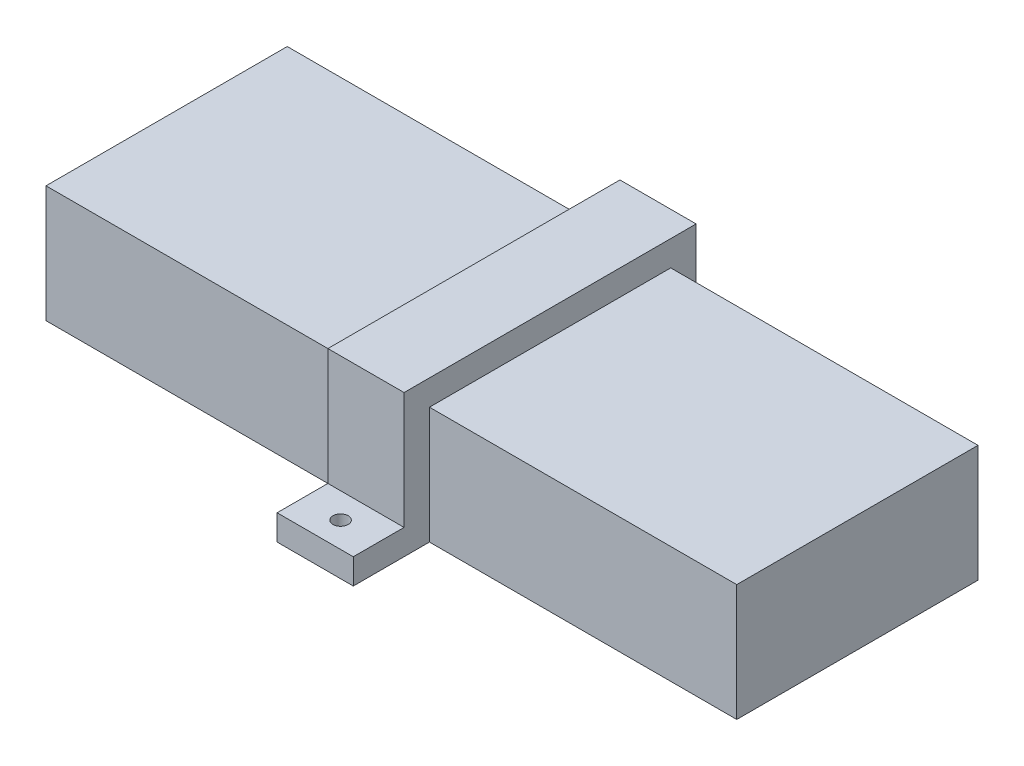
ISO-10303-21;
HEADER;
FILE_DESCRIPTION(('STEP AP214'),'2;1');
FILE_NAME('part.step','',(''),(''),'','','');
FILE_SCHEMA(('AUTOMOTIVE_DESIGN { 1 0 10303 214 1 1 1 1 }'));
ENDSEC;
DATA;
#1=APPLICATION_CONTEXT('core data for automotive mechanical design processes');
#2=APPLICATION_PROTOCOL_DEFINITION('international standard','automotive_design',2000,#1);
#3=PRODUCT_CONTEXT('',#1,'mechanical');
#4=PRODUCT('Part','Part','',(#3));
#5=PRODUCT_RELATED_PRODUCT_CATEGORY('part','',(#4));
#6=PRODUCT_DEFINITION_FORMATION('','',#4);
#7=PRODUCT_DEFINITION_CONTEXT('part definition',#1,'design');
#8=PRODUCT_DEFINITION('design','',#6,#7);
#9=PRODUCT_DEFINITION_SHAPE('','',#8);
#10=(LENGTH_UNIT() NAMED_UNIT(*) SI_UNIT(.MILLI.,.METRE.));
#11=(NAMED_UNIT(*) PLANE_ANGLE_UNIT() SI_UNIT($,.RADIAN.));
#12=(NAMED_UNIT(*) SI_UNIT($,.STERADIAN.) SOLID_ANGLE_UNIT());
#13=UNCERTAINTY_MEASURE_WITH_UNIT(LENGTH_MEASURE(1.E-05),#10,'distance_accuracy_value','');
#14=(GEOMETRIC_REPRESENTATION_CONTEXT(3) GLOBAL_UNCERTAINTY_ASSIGNED_CONTEXT((#13)) GLOBAL_UNIT_ASSIGNED_CONTEXT((#10,
#11,#12)) REPRESENTATION_CONTEXT('',''));
#15=CARTESIAN_POINT('',(0.,0.,0.));
#16=DIRECTION('',(0.,0.,1.));
#17=DIRECTION('',(1.,0.,0.));
#18=AXIS2_PLACEMENT_3D('',#15,#16,#17);
#19=CARTESIAN_POINT('',(7.5,23.,0.));
#20=DIRECTION('',(0.,1.,0.));
#21=DIRECTION('',(0.,0.,1.));
#22=AXIS2_PLACEMENT_3D('',#19,#20,#21);
#23=PLANE('',#22);
#24=DIRECTION('',(0.,0.,-1.));
#25=VECTOR('',#24,1.);
#26=CARTESIAN_POINT('',(-7.5,23.,0.));
#27=LINE('',#26,#25);
#28=CARTESIAN_POINT('',(-7.5,23.,23.75));
#29=VERTEX_POINT('',#28);
#30=CARTESIAN_POINT('',(-7.5,23.,-23.75));
#31=VERTEX_POINT('',#30);
#32=EDGE_CURVE('E173',#29,#31,#27,.T.);
#33=ORIENTED_EDGE('',*,*,#32,.T.);
#34=DIRECTION('',(-1.,0.,0.));
#35=VECTOR('',#34,1.);
#36=CARTESIAN_POINT('',(7.5,23.,-23.75));
#37=LINE('',#36,#35);
#38=CARTESIAN_POINT('',(7.5,23.,-23.75));
#39=VERTEX_POINT('',#38);
#40=EDGE_CURVE('E12',#39,#31,#37,.T.);
#41=ORIENTED_EDGE('',*,*,#40,.F.);
#42=DIRECTION('',(0.,0.,-1.));
#43=VECTOR('',#42,1.);
#44=CARTESIAN_POINT('',(7.5,23.,0.));
#45=LINE('',#44,#43);
#46=CARTESIAN_POINT('',(7.5,23.,23.75));
#47=VERTEX_POINT('',#46);
#48=EDGE_CURVE('E195',#47,#39,#45,.T.);
#49=ORIENTED_EDGE('',*,*,#48,.F.);
#50=DIRECTION('',(-1.,0.,0.));
#51=VECTOR('',#50,1.);
#52=CARTESIAN_POINT('',(7.5,23.,23.75));
#53=LINE('',#52,#51);
#54=EDGE_CURVE('E169',#47,#29,#53,.T.);
#55=ORIENTED_EDGE('',*,*,#54,.T.);
#56=EDGE_LOOP('',(#33,#41,#49,#55));
#57=FACE_BOUND('',#56,.T.);
#58=ADVANCED_FACE('F52',(#57),#23,.F.);
#59=CARTESIAN_POINT('',(7.5,0.,-23.75));
#60=DIRECTION('',(0.,0.,-1.));
#61=DIRECTION('',(-1.,0.,0.));
#62=AXIS2_PLACEMENT_3D('',#59,#60,#61);
#63=PLANE('',#62);
#64=DIRECTION('',(0.,-1.,0.));
#65=VECTOR('',#64,1.);
#66=CARTESIAN_POINT('',(-7.5,0.,-23.75));
#67=LINE('',#66,#65);
#68=CARTESIAN_POINT('',(-7.5,0.,-23.75));
#69=VERTEX_POINT('',#68);
#70=EDGE_CURVE('E176',#31,#69,#67,.T.);
#71=ORIENTED_EDGE('',*,*,#70,.T.);
#72=DIRECTION('',(-1.,0.,0.));
#73=VECTOR('',#72,1.);
#74=CARTESIAN_POINT('',(7.5,0.,-23.75));
#75=LINE('',#74,#73);
#76=CARTESIAN_POINT('',(7.5,0.,-23.75));
#77=VERTEX_POINT('',#76);
#78=EDGE_CURVE('E61',#77,#69,#75,.T.);
#79=ORIENTED_EDGE('',*,*,#78,.F.);
#80=DIRECTION('',(0.,-1.,0.));
#81=VECTOR('',#80,1.);
#82=CARTESIAN_POINT('',(7.5,0.,-23.75));
#83=LINE('',#82,#81);
#84=EDGE_CURVE('E124',#39,#77,#83,.T.);
#85=ORIENTED_EDGE('',*,*,#84,.F.);
#86=ORIENTED_EDGE('',*,*,#40,.T.);
#87=EDGE_LOOP('',(#71,#79,#85,#86));
#88=FACE_BOUND('',#87,.T.);
#89=ADVANCED_FACE('F275',(#88),#63,.F.);
#90=CARTESIAN_POINT('',(7.5,0.,0.));
#91=DIRECTION('',(0.,1.,0.));
#92=DIRECTION('',(0.,0.,1.));
#93=AXIS2_PLACEMENT_3D('',#90,#91,#92);
#94=PLANE('',#93);
#95=CARTESIAN_POINT('',(0.,0.,-33.75));
#96=DIRECTION('',(0.,1.,0.));
#97=DIRECTION('',(0.,0.,1.));
#98=AXIS2_PLACEMENT_3D('',#95,#96,#97);
#99=CIRCLE('',#98,1.5);
#100=CARTESIAN_POINT('',(0.,0.,-32.25));
#101=VERTEX_POINT('',#100);
#102=EDGE_CURVE('E409',#101,#101,#99,.T.);
#103=ORIENTED_EDGE('',*,*,#102,.T.);
#104=EDGE_LOOP('',(#103));
#105=FACE_BOUND('',#104,.T.);
#106=DIRECTION('',(0.,0.,-1.));
#107=VECTOR('',#106,1.);
#108=CARTESIAN_POINT('',(-7.5,0.,0.));
#109=LINE('',#108,#107);
#110=CARTESIAN_POINT('',(-7.5,0.,-38.75));
#111=VERTEX_POINT('',#110);
#112=EDGE_CURVE('E178',#69,#111,#109,.T.);
#113=ORIENTED_EDGE('',*,*,#112,.T.);
#114=DIRECTION('',(-1.,0.,0.));
#115=VECTOR('',#114,1.);
#116=CARTESIAN_POINT('',(7.5,0.,-38.75));
#117=LINE('',#116,#115);
#118=CARTESIAN_POINT('',(7.5,0.,-38.75));
#119=VERTEX_POINT('',#118);
#120=EDGE_CURVE('E214',#119,#111,#117,.T.);
#121=ORIENTED_EDGE('',*,*,#120,.F.);
#122=DIRECTION('',(0.,0.,-1.));
#123=VECTOR('',#122,1.);
#124=CARTESIAN_POINT('',(7.5,0.,0.));
#125=LINE('',#124,#123);
#126=EDGE_CURVE('E223',#77,#119,#125,.T.);
#127=ORIENTED_EDGE('',*,*,#126,.F.);
#128=ORIENTED_EDGE('',*,*,#78,.T.);
#129=EDGE_LOOP('',(#113,#121,#127,#128));
#130=FACE_BOUND('',#129,.T.);
#131=ADVANCED_FACE('F221',(#105,#130),#94,.F.);
#132=CARTESIAN_POINT('',(7.5,0.,-38.75));
#133=DIRECTION('',(0.,0.,1.));
#134=DIRECTION('',(1.,0.,0.));
#135=AXIS2_PLACEMENT_3D('',#132,#133,#134);
#136=PLANE('',#135);
#137=DIRECTION('',(0.,1.,0.));
#138=VECTOR('',#137,1.);
#139=CARTESIAN_POINT('',(-7.5,0.,-38.75));
#140=LINE('',#139,#138);
#141=CARTESIAN_POINT('',(-7.5,5.,-38.75));
#142=VERTEX_POINT('',#141);
#143=EDGE_CURVE('E180',#111,#142,#140,.T.);
#144=ORIENTED_EDGE('',*,*,#143,.T.);
#145=DIRECTION('',(-1.,0.,0.));
#146=VECTOR('',#145,1.);
#147=CARTESIAN_POINT('',(7.5,5.,-38.75));
#148=LINE('',#147,#146);
#149=CARTESIAN_POINT('',(7.5,5.,-38.75));
#150=VERTEX_POINT('',#149);
#151=EDGE_CURVE('E211',#150,#142,#148,.T.);
#152=ORIENTED_EDGE('',*,*,#151,.F.);
#153=DIRECTION('',(0.,1.,0.));
#154=VECTOR('',#153,1.);
#155=CARTESIAN_POINT('',(7.5,0.,-38.75));
#156=LINE('',#155,#154);
#157=EDGE_CURVE('E241',#119,#150,#156,.T.);
#158=ORIENTED_EDGE('',*,*,#157,.F.);
#159=ORIENTED_EDGE('',*,*,#120,.T.);
#160=EDGE_LOOP('',(#144,#152,#158,#159));
#161=FACE_BOUND('',#160,.T.);
#162=ADVANCED_FACE('F232',(#161),#136,.F.);
#163=CARTESIAN_POINT('',(7.5,4.99999999999999,0.));
#164=DIRECTION('',(0.,-1.,0.));
#165=DIRECTION('',(0.,0.,-1.));
#166=AXIS2_PLACEMENT_3D('',#163,#164,#165);
#167=PLANE('',#166);
#168=CARTESIAN_POINT('',(0.,5.,-33.75));
#169=DIRECTION('',(0.,-1.,0.));
#170=DIRECTION('',(0.,0.,-1.));
#171=AXIS2_PLACEMENT_3D('',#168,#169,#170);
#172=CIRCLE('',#171,1.5);
#173=CARTESIAN_POINT('',(0.,5.,-35.25));
#174=VERTEX_POINT('',#173);
#175=EDGE_CURVE('E55',#174,#174,#172,.F.);
#176=ORIENTED_EDGE('',*,*,#175,.F.);
#177=EDGE_LOOP('',(#176));
#178=FACE_BOUND('',#177,.T.);
#179=DIRECTION('',(0.,0.,1.));
#180=VECTOR('',#179,1.);
#181=CARTESIAN_POINT('',(-7.5,4.99999999999999,0.));
#182=LINE('',#181,#180);
#183=CARTESIAN_POINT('',(-7.5,5.,-28.75));
#184=VERTEX_POINT('',#183);
#185=EDGE_CURVE('E182',#142,#184,#182,.T.);
#186=ORIENTED_EDGE('',*,*,#185,.T.);
#187=DIRECTION('',(-1.,0.,0.));
#188=VECTOR('',#187,1.);
#189=CARTESIAN_POINT('',(7.5,5.,-28.75));
#190=LINE('',#189,#188);
#191=CARTESIAN_POINT('',(7.5,5.,-28.75));
#192=VERTEX_POINT('',#191);
#193=EDGE_CURVE('E208',#192,#184,#190,.T.);
#194=ORIENTED_EDGE('',*,*,#193,.F.);
#195=DIRECTION('',(0.,0.,1.));
#196=VECTOR('',#195,1.);
#197=CARTESIAN_POINT('',(7.5,4.99999999999999,0.));
#198=LINE('',#197,#196);
#199=EDGE_CURVE('E238',#150,#192,#198,.T.);
#200=ORIENTED_EDGE('',*,*,#199,.F.);
#201=ORIENTED_EDGE('',*,*,#151,.T.);
#202=EDGE_LOOP('',(#186,#194,#200,#201));
#203=FACE_BOUND('',#202,.T.);
#204=ADVANCED_FACE('F236',(#178,#203),#167,.F.);
#205=CARTESIAN_POINT('',(7.5,0.,-28.75));
#206=DIRECTION('',(0.,0.,1.));
#207=DIRECTION('',(1.,0.,0.));
#208=AXIS2_PLACEMENT_3D('',#205,#206,#207);
#209=PLANE('',#208);
#210=DIRECTION('',(0.,1.,0.));
#211=VECTOR('',#210,1.);
#212=CARTESIAN_POINT('',(-7.5,0.,-28.75));
#213=LINE('',#212,#211);
#214=CARTESIAN_POINT('',(-7.5,28.,-28.75));
#215=VERTEX_POINT('',#214);
#216=EDGE_CURVE('E184',#184,#215,#213,.T.);
#217=ORIENTED_EDGE('',*,*,#216,.T.);
#218=DIRECTION('',(-1.,0.,0.));
#219=VECTOR('',#218,1.);
#220=CARTESIAN_POINT('',(7.5,28.,-28.75));
#221=LINE('',#220,#219);
#222=CARTESIAN_POINT('',(7.5,28.,-28.75));
#223=VERTEX_POINT('',#222);
#224=EDGE_CURVE('E205',#223,#215,#221,.T.);
#225=ORIENTED_EDGE('',*,*,#224,.F.);
#226=DIRECTION('',(0.,1.,0.));
#227=VECTOR('',#226,1.);
#228=CARTESIAN_POINT('',(7.5,0.,-28.75));
#229=LINE('',#228,#227);
#230=EDGE_CURVE('E240',#192,#223,#229,.T.);
#231=ORIENTED_EDGE('',*,*,#230,.F.);
#232=ORIENTED_EDGE('',*,*,#193,.T.);
#233=EDGE_LOOP('',(#217,#225,#231,#232));
#234=FACE_BOUND('',#233,.T.);
#235=ADVANCED_FACE('F289',(#234),#209,.F.);
#236=CARTESIAN_POINT('',(7.5,28.,0.));
#237=DIRECTION('',(0.,-1.,0.));
#238=DIRECTION('',(0.,0.,-1.));
#239=AXIS2_PLACEMENT_3D('',#236,#237,#238);
#240=PLANE('',#239);
#241=DIRECTION('',(0.,0.,1.));
#242=VECTOR('',#241,1.);
#243=CARTESIAN_POINT('',(-7.5,28.,0.));
#244=LINE('',#243,#242);
#245=CARTESIAN_POINT('',(-7.5,28.,28.75));
#246=VERTEX_POINT('',#245);
#247=EDGE_CURVE('E186',#215,#246,#244,.T.);
#248=ORIENTED_EDGE('',*,*,#247,.T.);
#249=DIRECTION('',(-1.,0.,0.));
#250=VECTOR('',#249,1.);
#251=CARTESIAN_POINT('',(7.5,28.,28.75));
#252=LINE('',#251,#250);
#253=CARTESIAN_POINT('',(7.5,28.,28.75));
#254=VERTEX_POINT('',#253);
#255=EDGE_CURVE('E202',#254,#246,#252,.T.);
#256=ORIENTED_EDGE('',*,*,#255,.F.);
#257=DIRECTION('',(0.,0.,1.));
#258=VECTOR('',#257,1.);
#259=CARTESIAN_POINT('',(7.5,28.,0.));
#260=LINE('',#259,#258);
#261=EDGE_CURVE('E243',#223,#254,#260,.T.);
#262=ORIENTED_EDGE('',*,*,#261,.F.);
#263=ORIENTED_EDGE('',*,*,#224,.T.);
#264=EDGE_LOOP('',(#248,#256,#262,#263));
#265=FACE_BOUND('',#264,.T.);
#266=ADVANCED_FACE('F293',(#265),#240,.F.);
#267=CARTESIAN_POINT('',(7.5,0.,28.75));
#268=DIRECTION('',(0.,0.,-1.));
#269=DIRECTION('',(0.,1.,0.));
#270=AXIS2_PLACEMENT_3D('',#267,#268,#269);
#271=PLANE('',#270);
#272=DIRECTION('',(0.,-1.,0.));
#273=VECTOR('',#272,1.);
#274=CARTESIAN_POINT('',(-7.5,0.,28.75));
#275=LINE('',#274,#273);
#276=CARTESIAN_POINT('',(-7.5,5.,28.75));
#277=VERTEX_POINT('',#276);
#278=EDGE_CURVE('E188',#246,#277,#275,.T.);
#279=ORIENTED_EDGE('',*,*,#278,.T.);
#280=DIRECTION('',(-1.,0.,0.));
#281=VECTOR('',#280,1.);
#282=CARTESIAN_POINT('',(7.5,5.,28.75));
#283=LINE('',#282,#281);
#284=CARTESIAN_POINT('',(7.5,5.,28.75));
#285=VERTEX_POINT('',#284);
#286=EDGE_CURVE('E199',#285,#277,#283,.T.);
#287=ORIENTED_EDGE('',*,*,#286,.F.);
#288=DIRECTION('',(0.,-1.,0.));
#289=VECTOR('',#288,1.);
#290=CARTESIAN_POINT('',(7.5,0.,28.75));
#291=LINE('',#290,#289);
#292=EDGE_CURVE('E249',#254,#285,#291,.T.);
#293=ORIENTED_EDGE('',*,*,#292,.F.);
#294=ORIENTED_EDGE('',*,*,#255,.T.);
#295=EDGE_LOOP('',(#279,#287,#293,#294));
#296=FACE_BOUND('',#295,.T.);
#297=ADVANCED_FACE('F255',(#296),#271,.F.);
#298=CARTESIAN_POINT('',(7.5,5.,0.));
#299=DIRECTION('',(0.,-1.,0.));
#300=DIRECTION('',(0.,0.,-1.));
#301=AXIS2_PLACEMENT_3D('',#298,#299,#300);
#302=PLANE('',#301);
#303=CARTESIAN_POINT('',(0.,5.,33.75));
#304=DIRECTION('',(0.,-1.,0.));
#305=DIRECTION('',(0.,0.,-1.));
#306=AXIS2_PLACEMENT_3D('',#303,#304,#305);
#307=CIRCLE('',#306,1.5);
#308=CARTESIAN_POINT('',(0.,5.,32.25));
#309=VERTEX_POINT('',#308);
#310=EDGE_CURVE('E412',#309,#309,#307,.F.);
#311=ORIENTED_EDGE('',*,*,#310,.F.);
#312=EDGE_LOOP('',(#311));
#313=FACE_BOUND('',#312,.T.);
#314=DIRECTION('',(0.,0.,1.));
#315=VECTOR('',#314,1.);
#316=CARTESIAN_POINT('',(-7.5,5.,0.));
#317=LINE('',#316,#315);
#318=CARTESIAN_POINT('',(-7.5,5.,38.75));
#319=VERTEX_POINT('',#318);
#320=EDGE_CURVE('E190',#277,#319,#317,.T.);
#321=ORIENTED_EDGE('',*,*,#320,.T.);
#322=DIRECTION('',(-1.,0.,0.));
#323=VECTOR('',#322,1.);
#324=CARTESIAN_POINT('',(7.5,5.,38.75));
#325=LINE('',#324,#323);
#326=CARTESIAN_POINT('',(7.5,5.,38.75));
#327=VERTEX_POINT('',#326);
#328=EDGE_CURVE('E164',#327,#319,#325,.T.);
#329=ORIENTED_EDGE('',*,*,#328,.F.);
#330=DIRECTION('',(0.,0.,1.));
#331=VECTOR('',#330,1.);
#332=CARTESIAN_POINT('',(7.5,5.,0.));
#333=LINE('',#332,#331);
#334=EDGE_CURVE('E155',#285,#327,#333,.T.);
#335=ORIENTED_EDGE('',*,*,#334,.F.);
#336=ORIENTED_EDGE('',*,*,#286,.T.);
#337=EDGE_LOOP('',(#321,#329,#335,#336));
#338=FACE_BOUND('',#337,.T.);
#339=ADVANCED_FACE('F259',(#313,#338),#302,.F.);
#340=CARTESIAN_POINT('',(7.5,0.,38.75));
#341=DIRECTION('',(0.,0.,-1.));
#342=DIRECTION('',(-1.,0.,0.));
#343=AXIS2_PLACEMENT_3D('',#340,#341,#342);
#344=PLANE('',#343);
#345=DIRECTION('',(0.,-1.,0.));
#346=VECTOR('',#345,1.);
#347=CARTESIAN_POINT('',(-7.5,0.,38.75));
#348=LINE('',#347,#346);
#349=CARTESIAN_POINT('',(-7.5,0.,38.75));
#350=VERTEX_POINT('',#349);
#351=EDGE_CURVE('E163',#319,#350,#348,.T.);
#352=ORIENTED_EDGE('',*,*,#351,.T.);
#353=DIRECTION('',(-1.,0.,0.));
#354=VECTOR('',#353,1.);
#355=CARTESIAN_POINT('',(7.5,0.,38.75));
#356=LINE('',#355,#354);
#357=CARTESIAN_POINT('',(7.5,0.,38.75));
#358=VERTEX_POINT('',#357);
#359=EDGE_CURVE('E160',#358,#350,#356,.T.);
#360=ORIENTED_EDGE('',*,*,#359,.F.);
#361=DIRECTION('',(0.,-1.,0.));
#362=VECTOR('',#361,1.);
#363=CARTESIAN_POINT('',(7.5,0.,38.75));
#364=LINE('',#363,#362);
#365=EDGE_CURVE('E149',#327,#358,#364,.T.);
#366=ORIENTED_EDGE('',*,*,#365,.F.);
#367=ORIENTED_EDGE('',*,*,#328,.T.);
#368=EDGE_LOOP('',(#352,#360,#366,#367));
#369=FACE_BOUND('',#368,.T.);
#370=ADVANCED_FACE('F161',(#369),#344,.F.);
#371=CARTESIAN_POINT('',(7.5,0.,0.));
#372=DIRECTION('',(0.,1.,0.));
#373=DIRECTION('',(0.,0.,1.));
#374=AXIS2_PLACEMENT_3D('',#371,#372,#373);
#375=PLANE('',#374);
#376=CARTESIAN_POINT('',(0.,0.,33.75));
#377=DIRECTION('',(0.,1.,0.));
#378=DIRECTION('',(0.,0.,1.));
#379=AXIS2_PLACEMENT_3D('',#376,#377,#378);
#380=CIRCLE('',#379,1.5);
#381=CARTESIAN_POINT('',(0.,0.,35.25));
#382=VERTEX_POINT('',#381);
#383=EDGE_CURVE('E417',#382,#382,#380,.T.);
#384=ORIENTED_EDGE('',*,*,#383,.T.);
#385=EDGE_LOOP('',(#384));
#386=FACE_BOUND('',#385,.T.);
#387=DIRECTION('',(0.,0.,-1.));
#388=VECTOR('',#387,1.);
#389=CARTESIAN_POINT('',(-7.5,0.,0.));
#390=LINE('',#389,#388);
#391=CARTESIAN_POINT('',(-7.5,0.,23.75));
#392=VERTEX_POINT('',#391);
#393=EDGE_CURVE('E110',#350,#392,#390,.T.);
#394=ORIENTED_EDGE('',*,*,#393,.T.);
#395=DIRECTION('',(-1.,0.,0.));
#396=VECTOR('',#395,1.);
#397=CARTESIAN_POINT('',(7.5,0.,23.75));
#398=LINE('',#397,#396);
#399=CARTESIAN_POINT('',(7.5,0.,23.75));
#400=VERTEX_POINT('',#399);
#401=EDGE_CURVE('E165',#400,#392,#398,.T.);
#402=ORIENTED_EDGE('',*,*,#401,.F.);
#403=DIRECTION('',(0.,0.,-1.));
#404=VECTOR('',#403,1.);
#405=CARTESIAN_POINT('',(7.5,0.,0.));
#406=LINE('',#405,#404);
#407=EDGE_CURVE('E153',#358,#400,#406,.T.);
#408=ORIENTED_EDGE('',*,*,#407,.F.);
#409=ORIENTED_EDGE('',*,*,#359,.T.);
#410=EDGE_LOOP('',(#394,#402,#408,#409));
#411=FACE_BOUND('',#410,.T.);
#412=ADVANCED_FACE('F167',(#386,#411),#375,.F.);
#413=CARTESIAN_POINT('',(7.5,0.,23.75));
#414=DIRECTION('',(0.,0.,1.));
#415=DIRECTION('',(1.,0.,0.));
#416=AXIS2_PLACEMENT_3D('',#413,#414,#415);
#417=PLANE('',#416);
#418=DIRECTION('',(0.,1.,0.));
#419=VECTOR('',#418,1.);
#420=CARTESIAN_POINT('',(-7.5,0.,23.75));
#421=LINE('',#420,#419);
#422=EDGE_CURVE('E116',#392,#29,#421,.T.);
#423=ORIENTED_EDGE('',*,*,#422,.T.);
#424=ORIENTED_EDGE('',*,*,#54,.F.);
#425=DIRECTION('',(0.,1.,0.));
#426=VECTOR('',#425,1.);
#427=CARTESIAN_POINT('',(7.5,0.,23.75));
#428=LINE('',#427,#426);
#429=EDGE_CURVE('E69',#400,#47,#428,.T.);
#430=ORIENTED_EDGE('',*,*,#429,.F.);
#431=ORIENTED_EDGE('',*,*,#401,.T.);
#432=EDGE_LOOP('',(#423,#424,#430,#431));
#433=FACE_BOUND('',#432,.T.);
#434=ADVANCED_FACE('F263',(#433),#417,.F.);
#435=CARTESIAN_POINT('',(7.5,0.,0.));
#436=DIRECTION('',(1.,0.,0.));
#437=DIRECTION('',(0.,0.,-1.));
#438=AXIS2_PLACEMENT_3D('',#435,#436,#437);
#439=PLANE('',#438);
#440=ORIENTED_EDGE('',*,*,#48,.T.);
#441=ORIENTED_EDGE('',*,*,#84,.T.);
#442=ORIENTED_EDGE('',*,*,#126,.T.);
#443=ORIENTED_EDGE('',*,*,#157,.T.);
#444=ORIENTED_EDGE('',*,*,#199,.T.);
#445=ORIENTED_EDGE('',*,*,#230,.T.);
#446=ORIENTED_EDGE('',*,*,#261,.T.);
#447=ORIENTED_EDGE('',*,*,#292,.T.);
#448=ORIENTED_EDGE('',*,*,#334,.T.);
#449=ORIENTED_EDGE('',*,*,#365,.T.);
#450=ORIENTED_EDGE('',*,*,#407,.T.);
#451=ORIENTED_EDGE('',*,*,#429,.T.);
#452=EDGE_LOOP('',(#440,#441,#442,#443,#444,#445,#446,#447,#448,#449,#450,#451));
#453=FACE_BOUND('',#452,.T.);
#454=ADVANCED_FACE('F151',(#453),#439,.T.);
#455=CARTESIAN_POINT('',(-7.5,0.,0.));
#456=DIRECTION('',(1.,0.,0.));
#457=DIRECTION('',(0.,0.,-1.));
#458=AXIS2_PLACEMENT_3D('',#455,#456,#457);
#459=PLANE('',#458);
#460=ORIENTED_EDGE('',*,*,#32,.F.);
#461=ORIENTED_EDGE('',*,*,#422,.F.);
#462=ORIENTED_EDGE('',*,*,#393,.F.);
#463=ORIENTED_EDGE('',*,*,#351,.F.);
#464=ORIENTED_EDGE('',*,*,#320,.F.);
#465=ORIENTED_EDGE('',*,*,#278,.F.);
#466=ORIENTED_EDGE('',*,*,#247,.F.);
#467=ORIENTED_EDGE('',*,*,#216,.F.);
#468=ORIENTED_EDGE('',*,*,#185,.F.);
#469=ORIENTED_EDGE('',*,*,#143,.F.);
#470=ORIENTED_EDGE('',*,*,#112,.F.);
#471=ORIENTED_EDGE('',*,*,#70,.F.);
#472=EDGE_LOOP('',(#460,#461,#462,#463,#464,#465,#466,#467,#468,#469,#470,#471));
#473=FACE_BOUND('',#472,.T.);
#474=ADVANCED_FACE('F227',(#473),#459,.F.);
#475=CARTESIAN_POINT('',(0.,10.,33.75));
#476=DIRECTION('',(0.,-1.,0.));
#477=DIRECTION('',(0.,0.,-1.));
#478=AXIS2_PLACEMENT_3D('',#475,#476,#477);
#479=CYLINDRICAL_SURFACE('',#478,1.5);
#480=ORIENTED_EDGE('',*,*,#383,.F.);
#481=EDGE_LOOP('',(#480));
#482=FACE_BOUND('',#481,.T.);
#483=ORIENTED_EDGE('',*,*,#310,.T.);
#484=EDGE_LOOP('',(#483));
#485=FACE_BOUND('',#484,.T.);
#486=ADVANCED_FACE('F322',(#482,#485),#479,.F.);
#487=CARTESIAN_POINT('',(0.,10.,-33.75));
#488=DIRECTION('',(0.,-1.,0.));
#489=DIRECTION('',(0.,0.,-1.));
#490=AXIS2_PLACEMENT_3D('',#487,#488,#489);
#491=CYLINDRICAL_SURFACE('',#490,1.5);
#492=ORIENTED_EDGE('',*,*,#102,.F.);
#493=EDGE_LOOP('',(#492));
#494=FACE_BOUND('',#493,.T.);
#495=ORIENTED_EDGE('',*,*,#175,.T.);
#496=EDGE_LOOP('',(#495));
#497=FACE_BOUND('',#496,.T.);
#498=ADVANCED_FACE('F327',(#494,#497),#491,.F.);
#499=CLOSED_SHELL('',(#58,#89,#131,#162,#204,#235,#266,#297,#339,#370,#412,#434,#454,#474,#486,#498));
#500=MANIFOLD_SOLID_BREP('B2',#499);
#501=CARTESIAN_POINT('',(68.,23.,23.75));
#502=DIRECTION('',(-1.,0.,0.));
#503=DIRECTION('',(0.,0.,1.));
#504=AXIS2_PLACEMENT_3D('',#501,#502,#503);
#505=PLANE('',#504);
#506=DIRECTION('',(0.,0.,-1.));
#507=VECTOR('',#506,1.);
#508=CARTESIAN_POINT('',(68.,0.,23.75));
#509=LINE('',#508,#507);
#510=CARTESIAN_POINT('',(68.,0.,23.75));
#511=VERTEX_POINT('',#510);
#512=CARTESIAN_POINT('',(68.,0.,-23.75));
#513=VERTEX_POINT('',#512);
#514=EDGE_CURVE('E498',#511,#513,#509,.T.);
#515=ORIENTED_EDGE('',*,*,#514,.T.);
#516=DIRECTION('',(0.,-1.,0.));
#517=VECTOR('',#516,1.);
#518=CARTESIAN_POINT('',(68.,23.,-23.75));
#519=LINE('',#518,#517);
#520=CARTESIAN_POINT('',(68.,23.,-23.75));
#521=VERTEX_POINT('',#520);
#522=EDGE_CURVE('E50',#521,#513,#519,.T.);
#523=ORIENTED_EDGE('',*,*,#522,.F.);
#524=DIRECTION('',(0.,0.,-1.));
#525=VECTOR('',#524,1.);
#526=CARTESIAN_POINT('',(68.,23.,23.75));
#527=LINE('',#526,#525);
#528=CARTESIAN_POINT('',(68.,23.,23.75));
#529=VERTEX_POINT('',#528);
#530=EDGE_CURVE('E482',#529,#521,#527,.T.);
#531=ORIENTED_EDGE('',*,*,#530,.F.);
#532=DIRECTION('',(0.,-1.,0.));
#533=VECTOR('',#532,1.);
#534=CARTESIAN_POINT('',(68.,23.,23.75));
#535=LINE('',#534,#533);
#536=EDGE_CURVE('E494',#529,#511,#535,.T.);
#537=ORIENTED_EDGE('',*,*,#536,.T.);
#538=EDGE_LOOP('',(#515,#523,#531,#537));
#539=FACE_BOUND('',#538,.T.);
#540=ADVANCED_FACE('F430',(#539),#505,.F.);
#541=CARTESIAN_POINT('',(-68.,23.,-23.75));
#542=DIRECTION('',(0.,0.,1.));
#543=DIRECTION('',(1.,0.,0.));
#544=AXIS2_PLACEMENT_3D('',#541,#542,#543);
#545=PLANE('',#544);
#546=DIRECTION('',(-1.,0.,0.));
#547=VECTOR('',#546,1.);
#548=CARTESIAN_POINT('',(-68.,0.,-23.75));
#549=LINE('',#548,#547);
#550=CARTESIAN_POINT('',(-68.,0.,-23.75));
#551=VERTEX_POINT('',#550);
#552=EDGE_CURVE('E487',#513,#551,#549,.T.);
#553=ORIENTED_EDGE('',*,*,#552,.T.);
#554=DIRECTION('',(0.,-1.,0.));
#555=VECTOR('',#554,1.);
#556=CARTESIAN_POINT('',(-68.,23.,-23.75));
#557=LINE('',#556,#555);
#558=CARTESIAN_POINT('',(-68.,23.,-23.75));
#559=VERTEX_POINT('',#558);
#560=EDGE_CURVE('E439',#559,#551,#557,.T.);
#561=ORIENTED_EDGE('',*,*,#560,.F.);
#562=DIRECTION('',(-1.,0.,0.));
#563=VECTOR('',#562,1.);
#564=CARTESIAN_POINT('',(-68.,23.,-23.75));
#565=LINE('',#564,#563);
#566=EDGE_CURVE('E477',#521,#559,#565,.T.);
#567=ORIENTED_EDGE('',*,*,#566,.F.);
#568=ORIENTED_EDGE('',*,*,#522,.T.);
#569=EDGE_LOOP('',(#553,#561,#567,#568));
#570=FACE_BOUND('',#569,.T.);
#571=ADVANCED_FACE('F486',(#570),#545,.F.);
#572=CARTESIAN_POINT('',(-68.,23.,23.75));
#573=DIRECTION('',(1.,0.,0.));
#574=DIRECTION('',(0.,0.,-1.));
#575=AXIS2_PLACEMENT_3D('',#572,#573,#574);
#576=PLANE('',#575);
#577=DIRECTION('',(0.,0.,1.));
#578=VECTOR('',#577,1.);
#579=CARTESIAN_POINT('',(-68.,0.,23.75));
#580=LINE('',#579,#578);
#581=CARTESIAN_POINT('',(-68.,0.,23.75));
#582=VERTEX_POINT('',#581);
#583=EDGE_CURVE('E464',#551,#582,#580,.T.);
#584=ORIENTED_EDGE('',*,*,#583,.T.);
#585=DIRECTION('',(0.,-1.,0.));
#586=VECTOR('',#585,1.);
#587=CARTESIAN_POINT('',(-68.,23.,23.75));
#588=LINE('',#587,#586);
#589=CARTESIAN_POINT('',(-68.,23.,23.75));
#590=VERTEX_POINT('',#589);
#591=EDGE_CURVE('E489',#590,#582,#588,.T.);
#592=ORIENTED_EDGE('',*,*,#591,.F.);
#593=DIRECTION('',(0.,0.,1.));
#594=VECTOR('',#593,1.);
#595=CARTESIAN_POINT('',(-68.,23.,23.75));
#596=LINE('',#595,#594);
#597=EDGE_CURVE('E480',#559,#590,#596,.T.);
#598=ORIENTED_EDGE('',*,*,#597,.F.);
#599=ORIENTED_EDGE('',*,*,#560,.T.);
#600=EDGE_LOOP('',(#584,#592,#598,#599));
#601=FACE_BOUND('',#600,.T.);
#602=ADVANCED_FACE('F490',(#601),#576,.F.);
#603=CARTESIAN_POINT('',(-68.,23.,23.75));
#604=DIRECTION('',(0.,0.,-1.));
#605=DIRECTION('',(-1.,0.,0.));
#606=AXIS2_PLACEMENT_3D('',#603,#604,#605);
#607=PLANE('',#606);
#608=DIRECTION('',(1.,0.,0.));
#609=VECTOR('',#608,1.);
#610=CARTESIAN_POINT('',(-68.,0.,23.75));
#611=LINE('',#610,#609);
#612=EDGE_CURVE('E470',#582,#511,#611,.T.);
#613=ORIENTED_EDGE('',*,*,#612,.T.);
#614=ORIENTED_EDGE('',*,*,#536,.F.);
#615=DIRECTION('',(1.,0.,0.));
#616=VECTOR('',#615,1.);
#617=CARTESIAN_POINT('',(-68.,23.,23.75));
#618=LINE('',#617,#616);
#619=EDGE_CURVE('E447',#590,#529,#618,.T.);
#620=ORIENTED_EDGE('',*,*,#619,.F.);
#621=ORIENTED_EDGE('',*,*,#591,.T.);
#622=EDGE_LOOP('',(#613,#614,#620,#621));
#623=FACE_BOUND('',#622,.T.);
#624=ADVANCED_FACE('F511',(#623),#607,.F.);
#625=CARTESIAN_POINT('',(0.,23.,0.));
#626=DIRECTION('',(0.,-1.,0.));
#627=DIRECTION('',(0.,0.,-1.));
#628=AXIS2_PLACEMENT_3D('',#625,#626,#627);
#629=PLANE('',#628);
#630=ORIENTED_EDGE('',*,*,#530,.T.);
#631=ORIENTED_EDGE('',*,*,#566,.T.);
#632=ORIENTED_EDGE('',*,*,#597,.T.);
#633=ORIENTED_EDGE('',*,*,#619,.T.);
#634=EDGE_LOOP('',(#630,#631,#632,#633));
#635=FACE_BOUND('',#634,.T.);
#636=ADVANCED_FACE('F478',(#635),#629,.F.);
#637=CARTESIAN_POINT('',(0.,0.,0.));
#638=DIRECTION('',(0.,-1.,0.));
#639=DIRECTION('',(0.,0.,-1.));
#640=AXIS2_PLACEMENT_3D('',#637,#638,#639);
#641=PLANE('',#640);
#642=ORIENTED_EDGE('',*,*,#514,.F.);
#643=ORIENTED_EDGE('',*,*,#612,.F.);
#644=ORIENTED_EDGE('',*,*,#583,.F.);
#645=ORIENTED_EDGE('',*,*,#552,.F.);
#646=EDGE_LOOP('',(#642,#643,#644,#645));
#647=FACE_BOUND('',#646,.T.);
#648=ADVANCED_FACE('F514',(#647),#641,.T.);
#649=CLOSED_SHELL('',(#540,#571,#602,#624,#636,#648));
#650=MANIFOLD_SOLID_BREP('B6_NOT_SHOWN',#649);
#651=ADVANCED_BREP_SHAPE_REPRESENTATION('',(#18,#500,#650),#14);
#652=SHAPE_DEFINITION_REPRESENTATION(#9,#651);
ENDSEC;
END-ISO-10303-21;
